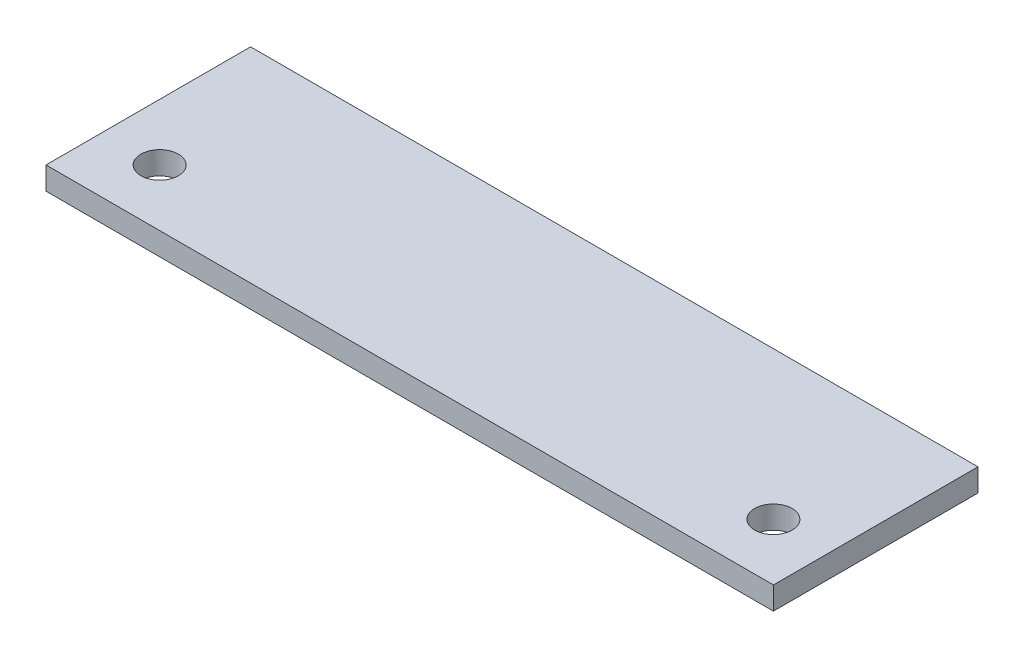
ISO-10303-21;
HEADER;
FILE_DESCRIPTION(('STEP AP214'),'2;1');
FILE_NAME('part.step','',(''),(''),'','','');
FILE_SCHEMA(('AUTOMOTIVE_DESIGN { 1 0 10303 214 1 1 1 1 }'));
ENDSEC;
DATA;
#1=APPLICATION_CONTEXT('core data for automotive mechanical design processes');
#2=APPLICATION_PROTOCOL_DEFINITION('international standard','automotive_design',2000,#1);
#3=PRODUCT_CONTEXT('',#1,'mechanical');
#4=PRODUCT('Part','Part','',(#3));
#5=PRODUCT_RELATED_PRODUCT_CATEGORY('part','',(#4));
#6=PRODUCT_DEFINITION_FORMATION('','',#4);
#7=PRODUCT_DEFINITION_CONTEXT('part definition',#1,'design');
#8=PRODUCT_DEFINITION('design','',#6,#7);
#9=PRODUCT_DEFINITION_SHAPE('','',#8);
#10=(LENGTH_UNIT() NAMED_UNIT(*) SI_UNIT(.MILLI.,.METRE.));
#11=(NAMED_UNIT(*) PLANE_ANGLE_UNIT() SI_UNIT($,.RADIAN.));
#12=(NAMED_UNIT(*) SI_UNIT($,.STERADIAN.) SOLID_ANGLE_UNIT());
#13=UNCERTAINTY_MEASURE_WITH_UNIT(LENGTH_MEASURE(1.E-05),#10,'distance_accuracy_value','');
#14=(GEOMETRIC_REPRESENTATION_CONTEXT(3) GLOBAL_UNCERTAINTY_ASSIGNED_CONTEXT((#13)) GLOBAL_UNIT_ASSIGNED_CONTEXT((#10,
#11,#12)) REPRESENTATION_CONTEXT('',''));
#15=CARTESIAN_POINT('',(0.,0.,0.));
#16=DIRECTION('',(0.,0.,1.));
#17=DIRECTION('',(1.,0.,0.));
#18=AXIS2_PLACEMENT_3D('',#15,#16,#17);
#19=CARTESIAN_POINT('',(0.,12.7,0.));
#20=DIRECTION('',(1.,0.,0.));
#21=DIRECTION('',(0.,0.,-1.));
#22=AXIS2_PLACEMENT_3D('',#19,#20,#21);
#23=PLANE('',#22);
#24=DIRECTION('',(0.,0.,1.));
#25=VECTOR('',#24,1.);
#26=CARTESIAN_POINT('',(0.,0.,0.));
#27=LINE('',#26,#25);
#28=CARTESIAN_POINT('',(0.,0.,-114.3));
#29=VERTEX_POINT('',#28);
#30=CARTESIAN_POINT('',(0.,0.,0.));
#31=VERTEX_POINT('',#30);
#32=EDGE_CURVE('E80',#29,#31,#27,.T.);
#33=ORIENTED_EDGE('',*,*,#32,.T.);
#34=DIRECTION('',(0.,-1.,0.));
#35=VECTOR('',#34,1.);
#36=CARTESIAN_POINT('',(0.,12.7,0.));
#37=LINE('',#36,#35);
#38=CARTESIAN_POINT('',(0.,12.7,0.));
#39=VERTEX_POINT('',#38);
#40=EDGE_CURVE('E11',#39,#31,#37,.T.);
#41=ORIENTED_EDGE('',*,*,#40,.F.);
#42=DIRECTION('',(0.,0.,1.));
#43=VECTOR('',#42,1.);
#44=CARTESIAN_POINT('',(0.,12.7,0.));
#45=LINE('',#44,#43);
#46=CARTESIAN_POINT('',(0.,12.7,-114.3));
#47=VERTEX_POINT('',#46);
#48=EDGE_CURVE('E68',#47,#39,#45,.T.);
#49=ORIENTED_EDGE('',*,*,#48,.F.);
#50=DIRECTION('',(0.,-1.,0.));
#51=VECTOR('',#50,1.);
#52=CARTESIAN_POINT('',(0.,12.7,-114.3));
#53=LINE('',#52,#51);
#54=EDGE_CURVE('E76',#47,#29,#53,.T.);
#55=ORIENTED_EDGE('',*,*,#54,.T.);
#56=EDGE_LOOP('',(#33,#41,#49,#55));
#57=FACE_BOUND('',#56,.T.);
#58=ADVANCED_FACE('F17',(#57),#23,.F.);
#59=CARTESIAN_POINT('',(0.,12.7,0.));
#60=DIRECTION('',(0.,0.,-1.));
#61=DIRECTION('',(-1.,0.,0.));
#62=AXIS2_PLACEMENT_3D('',#59,#60,#61);
#63=PLANE('',#62);
#64=DIRECTION('',(1.,0.,0.));
#65=VECTOR('',#64,1.);
#66=CARTESIAN_POINT('',(0.,0.,0.));
#67=LINE('',#66,#65);
#68=CARTESIAN_POINT('',(406.4,0.,0.));
#69=VERTEX_POINT('',#68);
#70=EDGE_CURVE('E72',#31,#69,#67,.T.);
#71=ORIENTED_EDGE('',*,*,#70,.T.);
#72=DIRECTION('',(0.,-1.,0.));
#73=VECTOR('',#72,1.);
#74=CARTESIAN_POINT('',(406.4,12.7,0.));
#75=LINE('',#74,#73);
#76=CARTESIAN_POINT('',(406.4,12.7,0.));
#77=VERTEX_POINT('',#76);
#78=EDGE_CURVE('E25',#77,#69,#75,.T.);
#79=ORIENTED_EDGE('',*,*,#78,.F.);
#80=DIRECTION('',(1.,0.,0.));
#81=VECTOR('',#80,1.);
#82=CARTESIAN_POINT('',(0.,12.7,0.));
#83=LINE('',#82,#81);
#84=EDGE_CURVE('E63',#39,#77,#83,.T.);
#85=ORIENTED_EDGE('',*,*,#84,.F.);
#86=ORIENTED_EDGE('',*,*,#40,.T.);
#87=EDGE_LOOP('',(#71,#79,#85,#86));
#88=FACE_BOUND('',#87,.T.);
#89=ADVANCED_FACE('F71',(#88),#63,.F.);
#90=CARTESIAN_POINT('',(406.4,12.7,0.));
#91=DIRECTION('',(-1.,0.,0.));
#92=DIRECTION('',(0.,0.,1.));
#93=AXIS2_PLACEMENT_3D('',#90,#91,#92);
#94=PLANE('',#93);
#95=DIRECTION('',(0.,0.,-1.));
#96=VECTOR('',#95,1.);
#97=CARTESIAN_POINT('',(406.4,0.,0.));
#98=LINE('',#97,#96);
#99=CARTESIAN_POINT('',(406.4,0.,-114.3));
#100=VERTEX_POINT('',#99);
#101=EDGE_CURVE('E50',#69,#100,#98,.T.);
#102=ORIENTED_EDGE('',*,*,#101,.T.);
#103=DIRECTION('',(0.,-1.,0.));
#104=VECTOR('',#103,1.);
#105=CARTESIAN_POINT('',(406.4,12.7,-114.3));
#106=LINE('',#105,#104);
#107=CARTESIAN_POINT('',(406.4,12.7,-114.3));
#108=VERTEX_POINT('',#107);
#109=EDGE_CURVE('E73',#108,#100,#106,.T.);
#110=ORIENTED_EDGE('',*,*,#109,.F.);
#111=DIRECTION('',(0.,0.,-1.));
#112=VECTOR('',#111,1.);
#113=CARTESIAN_POINT('',(406.4,12.7,0.));
#114=LINE('',#113,#112);
#115=EDGE_CURVE('E66',#77,#108,#114,.T.);
#116=ORIENTED_EDGE('',*,*,#115,.F.);
#117=ORIENTED_EDGE('',*,*,#78,.T.);
#118=EDGE_LOOP('',(#102,#110,#116,#117));
#119=FACE_BOUND('',#118,.T.);
#120=ADVANCED_FACE('F74',(#119),#94,.F.);
#121=CARTESIAN_POINT('',(0.,12.7,-114.3));
#122=DIRECTION('',(0.,0.,1.));
#123=DIRECTION('',(1.,0.,0.));
#124=AXIS2_PLACEMENT_3D('',#121,#122,#123);
#125=PLANE('',#124);
#126=DIRECTION('',(-1.,0.,0.));
#127=VECTOR('',#126,1.);
#128=CARTESIAN_POINT('',(0.,0.,-114.3));
#129=LINE('',#128,#127);
#130=EDGE_CURVE('E56',#100,#29,#129,.T.);
#131=ORIENTED_EDGE('',*,*,#130,.T.);
#132=ORIENTED_EDGE('',*,*,#54,.F.);
#133=DIRECTION('',(-1.,0.,0.));
#134=VECTOR('',#133,1.);
#135=CARTESIAN_POINT('',(0.,12.7,-114.3));
#136=LINE('',#135,#134);
#137=EDGE_CURVE('E33',#108,#47,#136,.T.);
#138=ORIENTED_EDGE('',*,*,#137,.F.);
#139=ORIENTED_EDGE('',*,*,#109,.T.);
#140=EDGE_LOOP('',(#131,#132,#138,#139));
#141=FACE_BOUND('',#140,.T.);
#142=ADVANCED_FACE('F88',(#141),#125,.F.);
#143=CARTESIAN_POINT('',(0.,12.7,-114.3));
#144=DIRECTION('',(0.,-1.,0.));
#145=DIRECTION('',(0.,0.,-1.));
#146=AXIS2_PLACEMENT_3D('',#143,#144,#145);
#147=PLANE('',#146);
#148=CARTESIAN_POINT('',(374.65,12.7,-31.75));
#149=DIRECTION('',(0.,1.,0.));
#150=DIRECTION('',(0.,0.,-1.));
#151=AXIS2_PLACEMENT_3D('',#148,#149,#150);
#152=CIRCLE('',#151,10.4775);
#153=CARTESIAN_POINT('',(374.65,12.7,-42.2275));
#154=VERTEX_POINT('',#153);
#155=EDGE_CURVE('E97',#154,#154,#152,.T.);
#156=ORIENTED_EDGE('',*,*,#155,.F.);
#157=EDGE_LOOP('',(#156));
#158=FACE_BOUND('',#157,.T.);
#159=CARTESIAN_POINT('',(31.75,12.7,-31.75));
#160=DIRECTION('',(0.,1.,0.));
#161=DIRECTION('',(0.,0.,1.));
#162=AXIS2_PLACEMENT_3D('',#159,#160,#161);
#163=CIRCLE('',#162,10.4775);
#164=CARTESIAN_POINT('',(31.75,12.7,-21.2725));
#165=VERTEX_POINT('',#164);
#166=EDGE_CURVE('E83',#165,#165,#163,.T.);
#167=ORIENTED_EDGE('',*,*,#166,.F.);
#168=EDGE_LOOP('',(#167));
#169=FACE_BOUND('',#168,.T.);
#170=ORIENTED_EDGE('',*,*,#48,.T.);
#171=ORIENTED_EDGE('',*,*,#84,.T.);
#172=ORIENTED_EDGE('',*,*,#115,.T.);
#173=ORIENTED_EDGE('',*,*,#137,.T.);
#174=EDGE_LOOP('',(#170,#171,#172,#173));
#175=FACE_BOUND('',#174,.T.);
#176=ADVANCED_FACE('F64',(#158,#169,#175),#147,.F.);
#177=CARTESIAN_POINT('',(0.,0.,-114.3));
#178=DIRECTION('',(0.,-1.,0.));
#179=DIRECTION('',(0.,0.,-1.));
#180=AXIS2_PLACEMENT_3D('',#177,#178,#179);
#181=PLANE('',#180);
#182=CARTESIAN_POINT('',(374.65,0.,-31.75));
#183=DIRECTION('',(0.,-1.,0.));
#184=DIRECTION('',(0.,0.,-1.));
#185=AXIS2_PLACEMENT_3D('',#182,#183,#184);
#186=CIRCLE('',#185,10.4775);
#187=CARTESIAN_POINT('',(374.65,0.,-42.2275));
#188=VERTEX_POINT('',#187);
#189=EDGE_CURVE('E100',#188,#188,#186,.F.);
#190=ORIENTED_EDGE('',*,*,#189,.T.);
#191=EDGE_LOOP('',(#190));
#192=FACE_BOUND('',#191,.T.);
#193=CARTESIAN_POINT('',(31.75,0.,-31.75));
#194=DIRECTION('',(0.,-1.,0.));
#195=DIRECTION('',(0.,0.,-1.));
#196=AXIS2_PLACEMENT_3D('',#193,#194,#195);
#197=CIRCLE('',#196,10.4775);
#198=CARTESIAN_POINT('',(31.75,0.,-42.2275));
#199=VERTEX_POINT('',#198);
#200=EDGE_CURVE('E94',#199,#199,#197,.F.);
#201=ORIENTED_EDGE('',*,*,#200,.T.);
#202=EDGE_LOOP('',(#201));
#203=FACE_BOUND('',#202,.T.);
#204=ORIENTED_EDGE('',*,*,#32,.F.);
#205=ORIENTED_EDGE('',*,*,#130,.F.);
#206=ORIENTED_EDGE('',*,*,#101,.F.);
#207=ORIENTED_EDGE('',*,*,#70,.F.);
#208=EDGE_LOOP('',(#204,#205,#206,#207));
#209=FACE_BOUND('',#208,.T.);
#210=ADVANCED_FACE('F91',(#192,#203,#209),#181,.T.);
#211=CARTESIAN_POINT('',(31.75,-0.000999999999999265,-31.75));
#212=DIRECTION('',(0.,1.,0.));
#213=DIRECTION('',(0.,0.,1.));
#214=AXIS2_PLACEMENT_3D('',#211,#212,#213);
#215=CYLINDRICAL_SURFACE('',#214,10.4775);
#216=ORIENTED_EDGE('',*,*,#200,.F.);
#217=EDGE_LOOP('',(#216));
#218=FACE_BOUND('',#217,.T.);
#219=ORIENTED_EDGE('',*,*,#166,.T.);
#220=EDGE_LOOP('',(#219));
#221=FACE_BOUND('',#220,.T.);
#222=ADVANCED_FACE('F113',(#218,#221),#215,.F.);
#223=CARTESIAN_POINT('',(374.65,-0.000999999999999265,-31.75));
#224=DIRECTION('',(0.,1.,0.));
#225=DIRECTION('',(0.,0.,1.));
#226=AXIS2_PLACEMENT_3D('',#223,#224,#225);
#227=CYLINDRICAL_SURFACE('',#226,10.4775);
#228=ORIENTED_EDGE('',*,*,#189,.F.);
#229=EDGE_LOOP('',(#228));
#230=FACE_BOUND('',#229,.T.);
#231=ORIENTED_EDGE('',*,*,#155,.T.);
#232=EDGE_LOOP('',(#231));
#233=FACE_BOUND('',#232,.T.);
#234=ADVANCED_FACE('F106',(#230,#233),#227,.F.);
#235=CLOSED_SHELL('',(#58,#89,#120,#142,#176,#210,#222,#234));
#236=MANIFOLD_SOLID_BREP('B1',#235);
#237=ADVANCED_BREP_SHAPE_REPRESENTATION('',(#18,#236),#14);
#238=SHAPE_DEFINITION_REPRESENTATION(#9,#237);
ENDSEC;
END-ISO-10303-21;
